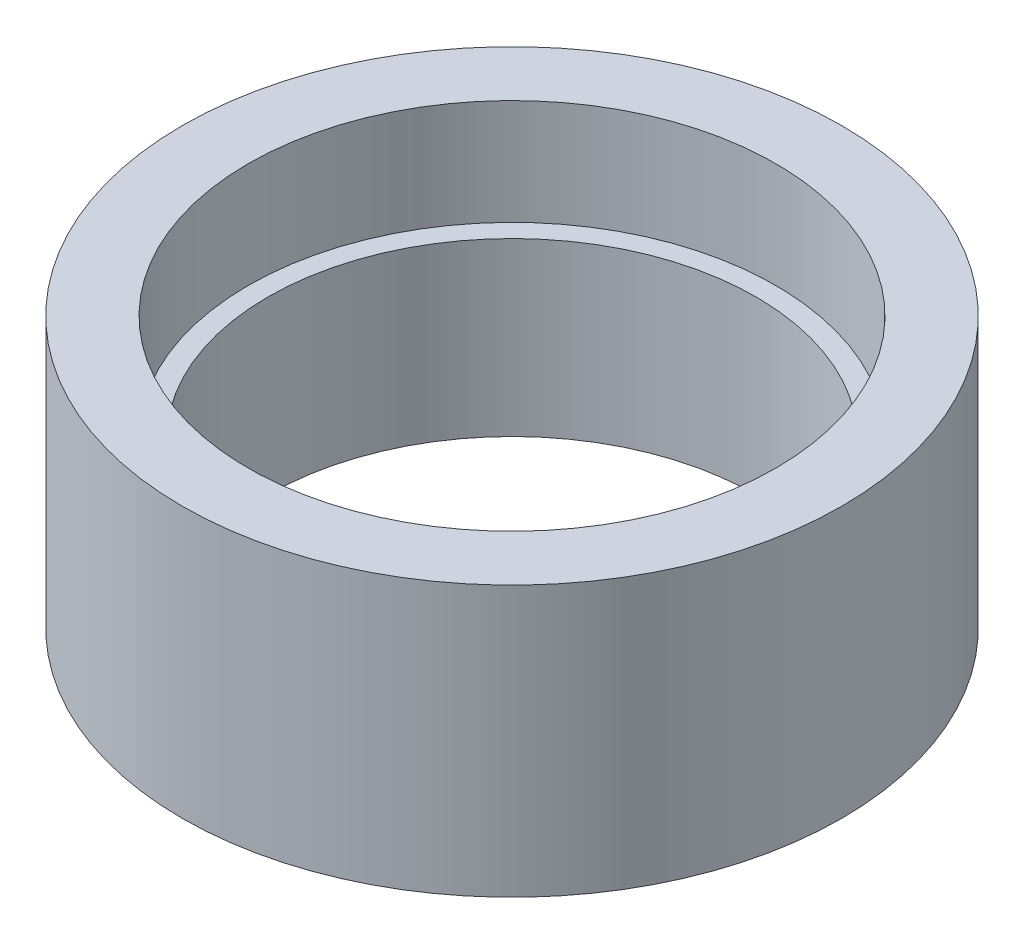
ISO-10303-21;
HEADER;
FILE_DESCRIPTION(('STEP AP214'),'2;1');
FILE_NAME('part.step','',(''),(''),'','','');
FILE_SCHEMA(('AUTOMOTIVE_DESIGN { 1 0 10303 214 1 1 1 1 }'));
ENDSEC;
DATA;
#1=APPLICATION_CONTEXT('core data for automotive mechanical design processes');
#2=APPLICATION_PROTOCOL_DEFINITION('international standard','automotive_design',2000,#1);
#3=PRODUCT_CONTEXT('',#1,'mechanical');
#4=PRODUCT('Part','Part','',(#3));
#5=PRODUCT_RELATED_PRODUCT_CATEGORY('part','',(#4));
#6=PRODUCT_DEFINITION_FORMATION('','',#4);
#7=PRODUCT_DEFINITION_CONTEXT('part definition',#1,'design');
#8=PRODUCT_DEFINITION('design','',#6,#7);
#9=PRODUCT_DEFINITION_SHAPE('','',#8);
#10=(LENGTH_UNIT() NAMED_UNIT(*) SI_UNIT(.MILLI.,.METRE.));
#11=(NAMED_UNIT(*) PLANE_ANGLE_UNIT() SI_UNIT($,.RADIAN.));
#12=(NAMED_UNIT(*) SI_UNIT($,.STERADIAN.) SOLID_ANGLE_UNIT());
#13=UNCERTAINTY_MEASURE_WITH_UNIT(LENGTH_MEASURE(1.E-05),#10,'distance_accuracy_value','');
#14=(GEOMETRIC_REPRESENTATION_CONTEXT(3) GLOBAL_UNCERTAINTY_ASSIGNED_CONTEXT((#13)) GLOBAL_UNIT_ASSIGNED_CONTEXT((#10,
#11,#12)) REPRESENTATION_CONTEXT('',''));
#15=CARTESIAN_POINT('',(0.,0.,0.));
#16=DIRECTION('',(0.,0.,1.));
#17=DIRECTION('',(1.,0.,0.));
#18=AXIS2_PLACEMENT_3D('',#15,#16,#17);
#19=CARTESIAN_POINT('',(0.,36.48622410148,0.));
#20=DIRECTION('',(0.,1.,0.));
#21=DIRECTION('',(-1.,0.,0.));
#22=AXIS2_PLACEMENT_3D('',#19,#20,#21);
#23=CYLINDRICAL_SURFACE('',#22,50.);
#24=CARTESIAN_POINT('',(0.,0.,0.));
#25=DIRECTION('',(0.,1.,0.));
#26=DIRECTION('',(-1.,0.,0.));
#27=AXIS2_PLACEMENT_3D('',#24,#25,#26);
#28=CIRCLE('',#27,50.);
#29=CARTESIAN_POINT('',(-50.,0.,0.));
#30=VERTEX_POINT('',#29);
#31=EDGE_CURVE('E59',#30,#30,#28,.T.);
#32=ORIENTED_EDGE('',*,*,#31,.F.);
#33=EDGE_LOOP('',(#32));
#34=FACE_BOUND('',#33,.T.);
#35=CARTESIAN_POINT('',(0.,-41.,0.));
#36=DIRECTION('',(0.,1.,0.));
#37=DIRECTION('',(-1.,0.,0.));
#38=AXIS2_PLACEMENT_3D('',#35,#36,#37);
#39=CIRCLE('',#38,50.);
#40=CARTESIAN_POINT('',(-50.0000000000001,-41.,0.));
#41=VERTEX_POINT('',#40);
#42=EDGE_CURVE('E10',#41,#41,#39,.T.);
#43=ORIENTED_EDGE('',*,*,#42,.T.);
#44=EDGE_LOOP('',(#43));
#45=FACE_BOUND('',#44,.T.);
#46=ADVANCED_FACE('F31',(#34,#45),#23,.T.);
#47=CARTESIAN_POINT('',(50.,-41.,0.));
#48=DIRECTION('',(0.,1.,0.));
#49=DIRECTION('',(-1.,0.,0.));
#50=AXIS2_PLACEMENT_3D('',#47,#48,#49);
#51=PLANE('',#50);
#52=ORIENTED_EDGE('',*,*,#42,.F.);
#53=EDGE_LOOP('',(#52));
#54=FACE_BOUND('',#53,.T.);
#55=CARTESIAN_POINT('',(0.,-41.,0.));
#56=DIRECTION('',(0.,1.,0.));
#57=DIRECTION('',(-1.,0.,0.));
#58=AXIS2_PLACEMENT_3D('',#55,#56,#57);
#59=CIRCLE('',#58,40.);
#60=CARTESIAN_POINT('',(-40.,-41.,0.));
#61=VERTEX_POINT('',#60);
#62=EDGE_CURVE('E37',#61,#61,#59,.T.);
#63=ORIENTED_EDGE('',*,*,#62,.T.);
#64=EDGE_LOOP('',(#63));
#65=FACE_BOUND('',#64,.T.);
#66=ADVANCED_FACE('F66',(#54,#65),#51,.F.);
#67=CARTESIAN_POINT('',(0.,36.48622410148,0.));
#68=DIRECTION('',(0.,1.,0.));
#69=DIRECTION('',(-1.,0.,0.));
#70=AXIS2_PLACEMENT_3D('',#67,#68,#69);
#71=CYLINDRICAL_SURFACE('',#70,40.);
#72=ORIENTED_EDGE('',*,*,#62,.F.);
#73=EDGE_LOOP('',(#72));
#74=FACE_BOUND('',#73,.T.);
#75=CARTESIAN_POINT('',(0.,-42.,0.));
#76=DIRECTION('',(0.,1.,0.));
#77=DIRECTION('',(-1.,0.,0.));
#78=AXIS2_PLACEMENT_3D('',#75,#76,#77);
#79=CIRCLE('',#78,40.);
#80=CARTESIAN_POINT('',(-40.,-42.,0.));
#81=VERTEX_POINT('',#80);
#82=EDGE_CURVE('E41',#81,#81,#79,.T.);
#83=ORIENTED_EDGE('',*,*,#82,.T.);
#84=EDGE_LOOP('',(#83));
#85=FACE_BOUND('',#84,.T.);
#86=ADVANCED_FACE('F70',(#74,#85),#71,.T.);
#87=CARTESIAN_POINT('',(40.,-42.,0.));
#88=DIRECTION('',(0.,1.,0.));
#89=DIRECTION('',(-1.,0.,0.));
#90=AXIS2_PLACEMENT_3D('',#87,#88,#89);
#91=PLANE('',#90);
#92=ORIENTED_EDGE('',*,*,#82,.F.);
#93=EDGE_LOOP('',(#92));
#94=FACE_BOUND('',#93,.T.);
#95=CARTESIAN_POINT('',(0.,-42.,0.));
#96=DIRECTION('',(0.,1.,0.));
#97=DIRECTION('',(-1.,0.,0.));
#98=AXIS2_PLACEMENT_3D('',#95,#96,#97);
#99=CIRCLE('',#98,37.);
#100=CARTESIAN_POINT('',(-37.,-42.,0.));
#101=VERTEX_POINT('',#100);
#102=EDGE_CURVE('E45',#101,#101,#99,.T.);
#103=ORIENTED_EDGE('',*,*,#102,.T.);
#104=EDGE_LOOP('',(#103));
#105=FACE_BOUND('',#104,.T.);
#106=ADVANCED_FACE('F75',(#94,#105),#91,.F.);
#107=CARTESIAN_POINT('',(0.,36.48622410148,0.));
#108=DIRECTION('',(0.,1.,0.));
#109=DIRECTION('',(-1.,0.,0.));
#110=AXIS2_PLACEMENT_3D('',#107,#108,#109);
#111=CYLINDRICAL_SURFACE('',#110,37.);
#112=ORIENTED_EDGE('',*,*,#102,.F.);
#113=EDGE_LOOP('',(#112));
#114=FACE_BOUND('',#113,.T.);
#115=CARTESIAN_POINT('',(0.,-16.,0.));
#116=DIRECTION('',(0.,1.,0.));
#117=DIRECTION('',(-1.,0.,0.));
#118=AXIS2_PLACEMENT_3D('',#115,#116,#117);
#119=CIRCLE('',#118,37.);
#120=CARTESIAN_POINT('',(-37.,-16.,0.));
#121=VERTEX_POINT('',#120);
#122=EDGE_CURVE('E50',#121,#121,#119,.T.);
#123=ORIENTED_EDGE('',*,*,#122,.T.);
#124=EDGE_LOOP('',(#123));
#125=FACE_BOUND('',#124,.T.);
#126=ADVANCED_FACE('F81',(#114,#125),#111,.F.);
#127=CARTESIAN_POINT('',(37.,-16.,0.));
#128=DIRECTION('',(0.,-1.,0.));
#129=DIRECTION('',(1.,0.,0.));
#130=AXIS2_PLACEMENT_3D('',#127,#128,#129);
#131=PLANE('',#130);
#132=ORIENTED_EDGE('',*,*,#122,.F.);
#133=EDGE_LOOP('',(#132));
#134=FACE_BOUND('',#133,.T.);
#135=CARTESIAN_POINT('',(0.,-16.,0.));
#136=DIRECTION('',(0.,1.,0.));
#137=DIRECTION('',(-1.,0.,0.));
#138=AXIS2_PLACEMENT_3D('',#135,#136,#137);
#139=CIRCLE('',#138,40.);
#140=CARTESIAN_POINT('',(-40.,-16.,0.));
#141=VERTEX_POINT('',#140);
#142=EDGE_CURVE('E53',#141,#141,#139,.T.);
#143=ORIENTED_EDGE('',*,*,#142,.T.);
#144=EDGE_LOOP('',(#143));
#145=FACE_BOUND('',#144,.T.);
#146=ADVANCED_FACE('F85',(#134,#145),#131,.F.);
#147=CARTESIAN_POINT('',(0.,36.48622410148,0.));
#148=DIRECTION('',(0.,1.,0.));
#149=DIRECTION('',(-1.,0.,0.));
#150=AXIS2_PLACEMENT_3D('',#147,#148,#149);
#151=CYLINDRICAL_SURFACE('',#150,40.);
#152=ORIENTED_EDGE('',*,*,#142,.F.);
#153=EDGE_LOOP('',(#152));
#154=FACE_BOUND('',#153,.T.);
#155=CARTESIAN_POINT('',(0.,0.,0.));
#156=DIRECTION('',(0.,1.,0.));
#157=DIRECTION('',(-1.,0.,0.));
#158=AXIS2_PLACEMENT_3D('',#155,#156,#157);
#159=CIRCLE('',#158,40.);
#160=CARTESIAN_POINT('',(-40.,0.,0.));
#161=VERTEX_POINT('',#160);
#162=EDGE_CURVE('E56',#161,#161,#159,.T.);
#163=ORIENTED_EDGE('',*,*,#162,.T.);
#164=EDGE_LOOP('',(#163));
#165=FACE_BOUND('',#164,.T.);
#166=ADVANCED_FACE('F89',(#154,#165),#151,.F.);
#167=CARTESIAN_POINT('',(40.,0.,0.));
#168=DIRECTION('',(0.,-1.,0.));
#169=DIRECTION('',(1.,0.,0.));
#170=AXIS2_PLACEMENT_3D('',#167,#168,#169);
#171=PLANE('',#170);
#172=ORIENTED_EDGE('',*,*,#162,.F.);
#173=EDGE_LOOP('',(#172));
#174=FACE_BOUND('',#173,.T.);
#175=ORIENTED_EDGE('',*,*,#31,.T.);
#176=EDGE_LOOP('',(#175));
#177=FACE_BOUND('',#176,.T.);
#178=ADVANCED_FACE('F63',(#174,#177),#171,.F.);
#179=CLOSED_SHELL('',(#46,#66,#86,#106,#126,#146,#166,#178));
#180=MANIFOLD_SOLID_BREP('B2',#179);
#181=ADVANCED_BREP_SHAPE_REPRESENTATION('',(#18,#180),#14);
#182=SHAPE_DEFINITION_REPRESENTATION(#9,#181);
ENDSEC;
END-ISO-10303-21;
